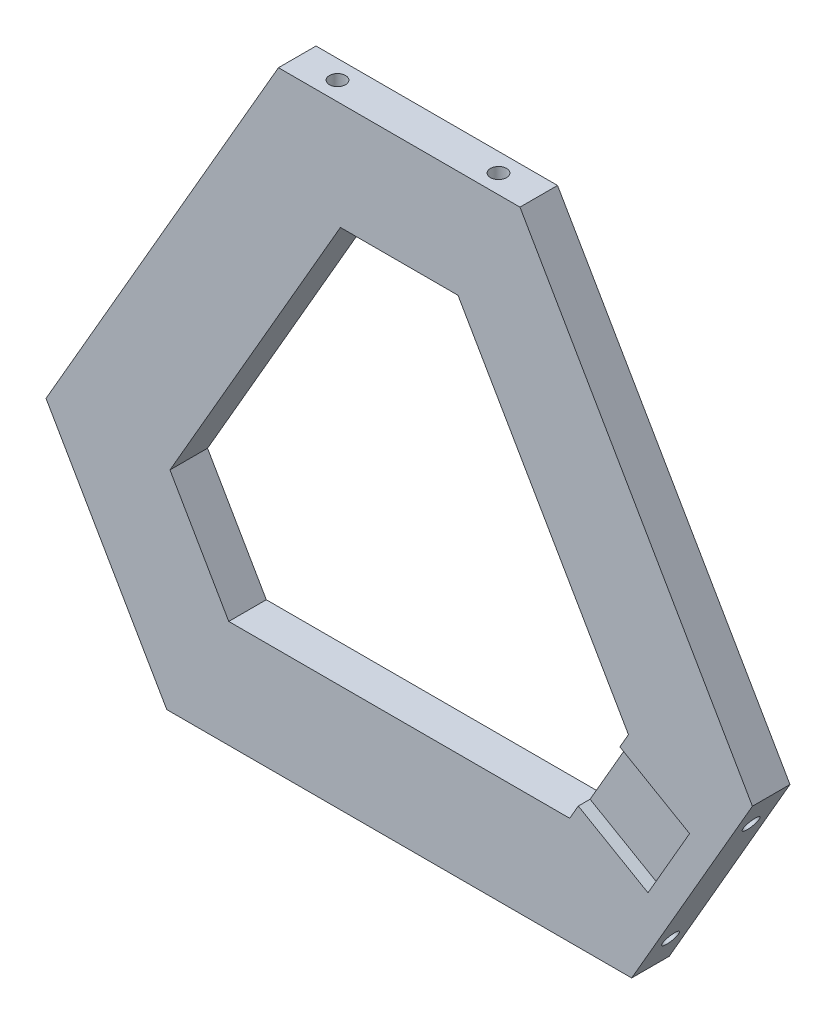
ISO-10303-21;
HEADER;
FILE_DESCRIPTION(('STEP AP214'),'2;1');
FILE_NAME('part.step','',(''),(''),'','','');
FILE_SCHEMA(('AUTOMOTIVE_DESIGN { 1 0 10303 214 1 1 1 1 }'));
ENDSEC;
DATA;
#1=APPLICATION_CONTEXT('core data for automotive mechanical design processes');
#2=APPLICATION_PROTOCOL_DEFINITION('international standard','automotive_design',2000,#1);
#3=PRODUCT_CONTEXT('',#1,'mechanical');
#4=PRODUCT('Part','Part','',(#3));
#5=PRODUCT_RELATED_PRODUCT_CATEGORY('part','',(#4));
#6=PRODUCT_DEFINITION_FORMATION('','',#4);
#7=PRODUCT_DEFINITION_CONTEXT('part definition',#1,'design');
#8=PRODUCT_DEFINITION('design','',#6,#7);
#9=PRODUCT_DEFINITION_SHAPE('','',#8);
#10=(LENGTH_UNIT() NAMED_UNIT(*) SI_UNIT(.MILLI.,.METRE.));
#11=(NAMED_UNIT(*) PLANE_ANGLE_UNIT() SI_UNIT($,.RADIAN.));
#12=(NAMED_UNIT(*) SI_UNIT($,.STERADIAN.) SOLID_ANGLE_UNIT());
#13=UNCERTAINTY_MEASURE_WITH_UNIT(LENGTH_MEASURE(1.E-05),#10,'distance_accuracy_value','');
#14=(GEOMETRIC_REPRESENTATION_CONTEXT(3) GLOBAL_UNCERTAINTY_ASSIGNED_CONTEXT((#13)) GLOBAL_UNIT_ASSIGNED_CONTEXT((#10,
#11,#12)) REPRESENTATION_CONTEXT('',''));
#15=CARTESIAN_POINT('',(0.,0.,0.));
#16=DIRECTION('',(0.,0.,1.));
#17=DIRECTION('',(1.,0.,0.));
#18=AXIS2_PLACEMENT_3D('',#15,#16,#17);
#19=CARTESIAN_POINT('',(37.2390923627309,-21.5,0.));
#20=DIRECTION('',(0.866025403784439,-0.5,0.));
#21=DIRECTION('',(0.5,0.866025403784439,0.));
#22=AXIS2_PLACEMENT_3D('',#19,#20,#21);
#23=PLANE('',#22);
#24=DIRECTION('',(0.5,0.866025403784439,0.));
#25=VECTOR('',#24,1.);
#26=CARTESIAN_POINT('',(37.2390923627309,-21.5,0.));
#27=LINE('',#26,#25);
#28=CARTESIAN_POINT('',(41.1140923627309,-14.7883031206706,0.));
#29=VERTEX_POINT('',#28);
#30=CARTESIAN_POINT('',(42.7155896708346,-12.0144284148501,0.));
#31=VERTEX_POINT('',#30);
#32=EDGE_CURVE('E173',#29,#31,#27,.T.);
#33=ORIENTED_EDGE('',*,*,#32,.F.);
#34=DIRECTION('',(0.,0.,1.));
#35=VECTOR('',#34,1.);
#36=CARTESIAN_POINT('',(41.1140923627309,-14.7883031206706,4.8));
#37=LINE('',#36,#35);
#38=CARTESIAN_POINT('',(41.1140923627309,-14.7883031206706,7.));
#39=VERTEX_POINT('',#38);
#40=EDGE_CURVE('E159',#29,#39,#37,.T.);
#41=ORIENTED_EDGE('',*,*,#40,.T.);
#42=DIRECTION('',(0.5,0.866025403784439,0.));
#43=VECTOR('',#42,1.);
#44=CARTESIAN_POINT('',(37.2390923627309,-21.5,7.));
#45=LINE('',#44,#43);
#46=CARTESIAN_POINT('',(42.7155896708346,-12.0144284148501,7.));
#47=VERTEX_POINT('',#46);
#48=EDGE_CURVE('E55',#39,#47,#45,.T.);
#49=ORIENTED_EDGE('',*,*,#48,.T.);
#50=DIRECTION('',(0.,0.,1.));
#51=VECTOR('',#50,1.);
#52=CARTESIAN_POINT('',(42.7155896708346,-12.0144284148501,0.));
#53=LINE('',#52,#51);
#54=EDGE_CURVE('E180',#31,#47,#53,.T.);
#55=ORIENTED_EDGE('',*,*,#54,.F.);
#56=EDGE_LOOP('',(#33,#41,#49,#55));
#57=FACE_BOUND('',#56,.T.);
#58=ADVANCED_FACE('F32',(#57),#23,.F.);
#59=CARTESIAN_POINT('',(-65.8096004384197,-12.0144284148501,7.));
#60=DIRECTION('',(0.866025403784438,-0.5,0.));
#61=DIRECTION('',(0.5,0.866025403784439,0.));
#62=AXIS2_PLACEMENT_3D('',#59,#60,#61);
#63=PLANE('',#62);
#64=DIRECTION('',(-0.5,-0.866025403784438,0.));
#65=VECTOR('',#64,1.);
#66=CARTESIAN_POINT('',(-65.8096004384197,-12.0144284148501,0.));
#67=LINE('',#66,#65);
#68=CARTESIAN_POINT('',(-22.5,63.,0.));
#69=VERTEX_POINT('',#68);
#70=CARTESIAN_POINT('',(-65.8096004384197,-12.0144284148501,0.));
#71=VERTEX_POINT('',#70);
#72=EDGE_CURVE('E266',#69,#71,#67,.T.);
#73=ORIENTED_EDGE('',*,*,#72,.T.);
#74=DIRECTION('',(0.,0.,-1.));
#75=VECTOR('',#74,1.);
#76=CARTESIAN_POINT('',(-65.8096004384197,-12.0144284148501,7.));
#77=LINE('',#76,#75);
#78=CARTESIAN_POINT('',(-65.8096004384197,-12.0144284148501,7.));
#79=VERTEX_POINT('',#78);
#80=EDGE_CURVE('E11',#79,#71,#77,.T.);
#81=ORIENTED_EDGE('',*,*,#80,.F.);
#82=DIRECTION('',(-0.5,-0.866025403784438,0.));
#83=VECTOR('',#82,1.);
#84=CARTESIAN_POINT('',(-65.8096004384197,-12.0144284148501,7.));
#85=LINE('',#84,#83);
#86=CARTESIAN_POINT('',(-22.5,63.,7.));
#87=VERTEX_POINT('',#86);
#88=EDGE_CURVE('E269',#87,#79,#85,.T.);
#89=ORIENTED_EDGE('',*,*,#88,.F.);
#90=DIRECTION('',(0.,0.,-1.));
#91=VECTOR('',#90,1.);
#92=CARTESIAN_POINT('',(-22.5,63.,7.));
#93=LINE('',#92,#91);
#94=EDGE_CURVE('E283',#87,#69,#93,.T.);
#95=ORIENTED_EDGE('',*,*,#94,.T.);
#96=EDGE_LOOP('',(#73,#81,#89,#95));
#97=FACE_BOUND('',#96,.T.);
#98=ADVANCED_FACE('F34',(#97),#63,.F.);
#99=CARTESIAN_POINT('',(-43.3096004384196,-50.9855715851499,7.));
#100=DIRECTION('',(0.866025403784438,0.500000000000001,0.));
#101=DIRECTION('',(-0.500000000000001,0.866025403784438,0.));
#102=AXIS2_PLACEMENT_3D('',#99,#100,#101);
#103=PLANE('',#102);
#104=CARTESIAN_POINT('',(-47.0596004384196,-44.4903810567666,3.5));
#105=DIRECTION('',(-0.866025403784438,-0.500000000000001,0.));
#106=DIRECTION('',(-0.500000000000001,0.866025403784438,0.));
#107=AXIS2_PLACEMENT_3D('',#104,#105,#106);
#108=CIRCLE('',#107,1.5);
#109=CARTESIAN_POINT('',(-47.8096004384196,-43.19134295109,3.5));
#110=VERTEX_POINT('',#109);
#111=EDGE_CURVE('E254',#110,#110,#108,.T.);
#112=ORIENTED_EDGE('',*,*,#111,.F.);
#113=EDGE_LOOP('',(#112));
#114=FACE_BOUND('',#113,.T.);
#115=CARTESIAN_POINT('',(-62.0596004384196,-18.5096189432335,3.5));
#116=DIRECTION('',(-0.866025403784438,-0.500000000000001,0.));
#117=DIRECTION('',(0.500000000000001,-0.866025403784438,0.));
#118=AXIS2_PLACEMENT_3D('',#115,#116,#117);
#119=CIRCLE('',#118,1.5);
#120=CARTESIAN_POINT('',(-61.3096004384196,-19.8086570489101,3.5));
#121=VERTEX_POINT('',#120);
#122=EDGE_CURVE('E260',#121,#121,#119,.T.);
#123=ORIENTED_EDGE('',*,*,#122,.F.);
#124=EDGE_LOOP('',(#123));
#125=FACE_BOUND('',#124,.T.);
#126=DIRECTION('',(0.500000000000001,-0.866025403784438,0.));
#127=VECTOR('',#126,1.);
#128=CARTESIAN_POINT('',(-43.3096004384196,-50.9855715851499,0.));
#129=LINE('',#128,#127);
#130=CARTESIAN_POINT('',(-43.3096004384196,-50.9855715851499,0.));
#131=VERTEX_POINT('',#130);
#132=EDGE_CURVE('E286',#71,#131,#129,.T.);
#133=ORIENTED_EDGE('',*,*,#132,.T.);
#134=DIRECTION('',(0.,0.,-1.));
#135=VECTOR('',#134,1.);
#136=CARTESIAN_POINT('',(-43.3096004384196,-50.9855715851499,7.));
#137=LINE('',#136,#135);
#138=CARTESIAN_POINT('',(-43.3096004384196,-50.9855715851499,7.));
#139=VERTEX_POINT('',#138);
#140=EDGE_CURVE('E40',#139,#131,#137,.T.);
#141=ORIENTED_EDGE('',*,*,#140,.F.);
#142=DIRECTION('',(0.500000000000001,-0.866025403784438,0.));
#143=VECTOR('',#142,1.);
#144=CARTESIAN_POINT('',(-43.3096004384196,-50.9855715851499,7.));
#145=LINE('',#144,#143);
#146=EDGE_CURVE('E272',#79,#139,#145,.T.);
#147=ORIENTED_EDGE('',*,*,#146,.F.);
#148=ORIENTED_EDGE('',*,*,#80,.T.);
#149=EDGE_LOOP('',(#133,#141,#147,#148));
#150=FACE_BOUND('',#149,.T.);
#151=ADVANCED_FACE('F331',(#114,#125,#150),#103,.F.);
#152=CARTESIAN_POINT('',(43.3096004384196,-50.9855715851499,7.));
#153=DIRECTION('',(0.,1.,0.));
#154=DIRECTION('',(-1.,0.,0.));
#155=AXIS2_PLACEMENT_3D('',#152,#153,#154);
#156=PLANE('',#155);
#157=DIRECTION('',(1.,0.,0.));
#158=VECTOR('',#157,1.);
#159=CARTESIAN_POINT('',(43.3096004384196,-50.9855715851499,0.));
#160=LINE('',#159,#158);
#161=CARTESIAN_POINT('',(43.3096004384196,-50.9855715851499,0.));
#162=VERTEX_POINT('',#161);
#163=EDGE_CURVE('E288',#131,#162,#160,.T.);
#164=ORIENTED_EDGE('',*,*,#163,.T.);
#165=DIRECTION('',(0.,0.,-1.));
#166=VECTOR('',#165,1.);
#167=CARTESIAN_POINT('',(43.3096004384196,-50.9855715851499,7.));
#168=LINE('',#167,#166);
#169=CARTESIAN_POINT('',(43.3096004384196,-50.9855715851499,7.));
#170=VERTEX_POINT('',#169);
#171=EDGE_CURVE('E303',#170,#162,#168,.T.);
#172=ORIENTED_EDGE('',*,*,#171,.F.);
#173=DIRECTION('',(1.,0.,0.));
#174=VECTOR('',#173,1.);
#175=CARTESIAN_POINT('',(43.3096004384196,-50.9855715851499,7.));
#176=LINE('',#175,#174);
#177=EDGE_CURVE('E275',#139,#170,#176,.T.);
#178=ORIENTED_EDGE('',*,*,#177,.F.);
#179=ORIENTED_EDGE('',*,*,#140,.T.);
#180=EDGE_LOOP('',(#164,#172,#178,#179));
#181=FACE_BOUND('',#180,.T.);
#182=ADVANCED_FACE('F310',(#181),#156,.F.);
#183=CARTESIAN_POINT('',(65.8096004384196,-12.0144284148501,7.));
#184=DIRECTION('',(-0.866025403784439,0.5,0.));
#185=DIRECTION('',(-0.5,-0.866025403784439,0.));
#186=AXIS2_PLACEMENT_3D('',#183,#184,#185);
#187=PLANE('',#186);
#188=CARTESIAN_POINT('',(47.0596004384196,-44.4903810567666,3.5));
#189=DIRECTION('',(0.866025403784439,-0.5,0.));
#190=DIRECTION('',(-0.5,-0.866025403784439,0.));
#191=AXIS2_PLACEMENT_3D('',#188,#189,#190);
#192=CIRCLE('',#191,1.5);
#193=CARTESIAN_POINT('',(46.3096004384196,-45.7894191624432,3.5));
#194=VERTEX_POINT('',#193);
#195=EDGE_CURVE('E242',#194,#194,#192,.T.);
#196=ORIENTED_EDGE('',*,*,#195,.F.);
#197=EDGE_LOOP('',(#196));
#198=FACE_BOUND('',#197,.T.);
#199=CARTESIAN_POINT('',(62.0596004384196,-18.5096189432334,3.5));
#200=DIRECTION('',(0.866025403784439,-0.5,0.));
#201=DIRECTION('',(0.5,0.866025403784439,0.));
#202=AXIS2_PLACEMENT_3D('',#199,#200,#201);
#203=CIRCLE('',#202,1.5);
#204=CARTESIAN_POINT('',(62.8096004384196,-17.2105808375568,3.5));
#205=VERTEX_POINT('',#204);
#206=EDGE_CURVE('E248',#205,#205,#203,.T.);
#207=ORIENTED_EDGE('',*,*,#206,.F.);
#208=EDGE_LOOP('',(#207));
#209=FACE_BOUND('',#208,.T.);
#210=DIRECTION('',(0.5,0.866025403784439,0.));
#211=VECTOR('',#210,1.);
#212=CARTESIAN_POINT('',(65.8096004384196,-12.0144284148501,0.));
#213=LINE('',#212,#211);
#214=CARTESIAN_POINT('',(65.8096004384196,-12.0144284148501,0.));
#215=VERTEX_POINT('',#214);
#216=EDGE_CURVE('E290',#162,#215,#213,.T.);
#217=ORIENTED_EDGE('',*,*,#216,.T.);
#218=DIRECTION('',(0.,0.,-1.));
#219=VECTOR('',#218,1.);
#220=CARTESIAN_POINT('',(65.8096004384196,-12.0144284148501,7.));
#221=LINE('',#220,#219);
#222=CARTESIAN_POINT('',(65.8096004384196,-12.0144284148501,7.));
#223=VERTEX_POINT('',#222);
#224=EDGE_CURVE('E300',#223,#215,#221,.T.);
#225=ORIENTED_EDGE('',*,*,#224,.F.);
#226=DIRECTION('',(0.5,0.866025403784439,0.));
#227=VECTOR('',#226,1.);
#228=CARTESIAN_POINT('',(65.8096004384196,-12.0144284148501,7.));
#229=LINE('',#228,#227);
#230=EDGE_CURVE('E277',#170,#223,#229,.T.);
#231=ORIENTED_EDGE('',*,*,#230,.F.);
#232=ORIENTED_EDGE('',*,*,#171,.T.);
#233=EDGE_LOOP('',(#217,#225,#231,#232));
#234=FACE_BOUND('',#233,.T.);
#235=ADVANCED_FACE('F319',(#198,#209,#234),#187,.F.);
#236=CARTESIAN_POINT('',(22.5,63.,7.));
#237=DIRECTION('',(-0.866025403784439,-0.5,0.));
#238=DIRECTION('',(0.5,-0.866025403784439,0.));
#239=AXIS2_PLACEMENT_3D('',#236,#237,#238);
#240=PLANE('',#239);
#241=DIRECTION('',(-0.5,0.866025403784439,0.));
#242=VECTOR('',#241,1.);
#243=CARTESIAN_POINT('',(22.5,63.,0.));
#244=LINE('',#243,#242);
#245=CARTESIAN_POINT('',(22.5,63.,0.));
#246=VERTEX_POINT('',#245);
#247=EDGE_CURVE('E292',#215,#246,#244,.T.);
#248=ORIENTED_EDGE('',*,*,#247,.T.);
#249=DIRECTION('',(0.,0.,-1.));
#250=VECTOR('',#249,1.);
#251=CARTESIAN_POINT('',(22.5,63.,7.));
#252=LINE('',#251,#250);
#253=CARTESIAN_POINT('',(22.5,63.,7.));
#254=VERTEX_POINT('',#253);
#255=EDGE_CURVE('E297',#254,#246,#252,.T.);
#256=ORIENTED_EDGE('',*,*,#255,.F.);
#257=DIRECTION('',(-0.5,0.866025403784439,0.));
#258=VECTOR('',#257,1.);
#259=CARTESIAN_POINT('',(22.5,63.,7.));
#260=LINE('',#259,#258);
#261=EDGE_CURVE('E279',#223,#254,#260,.T.);
#262=ORIENTED_EDGE('',*,*,#261,.F.);
#263=ORIENTED_EDGE('',*,*,#224,.T.);
#264=EDGE_LOOP('',(#248,#256,#262,#263));
#265=FACE_BOUND('',#264,.T.);
#266=ADVANCED_FACE('F323',(#265),#240,.F.);
#267=CARTESIAN_POINT('',(-22.5,63.,7.));
#268=DIRECTION('',(0.,-1.,0.));
#269=DIRECTION('',(0.,0.,-1.));
#270=AXIS2_PLACEMENT_3D('',#267,#268,#269);
#271=PLANE('',#270);
#272=CARTESIAN_POINT('',(15.,63.,3.5));
#273=DIRECTION('',(0.,1.,0.));
#274=DIRECTION('',(0.,0.,-1.));
#275=AXIS2_PLACEMENT_3D('',#272,#273,#274);
#276=CIRCLE('',#275,1.5);
#277=CARTESIAN_POINT('',(15.,63.,2.));
#278=VERTEX_POINT('',#277);
#279=EDGE_CURVE('E223',#278,#278,#276,.T.);
#280=ORIENTED_EDGE('',*,*,#279,.F.);
#281=EDGE_LOOP('',(#280));
#282=FACE_BOUND('',#281,.T.);
#283=CARTESIAN_POINT('',(-15.,63.,3.5));
#284=DIRECTION('',(0.,1.,0.));
#285=DIRECTION('',(0.,0.,1.));
#286=AXIS2_PLACEMENT_3D('',#283,#284,#285);
#287=CIRCLE('',#286,1.5);
#288=CARTESIAN_POINT('',(-15.,63.,5.));
#289=VERTEX_POINT('',#288);
#290=EDGE_CURVE('E236',#289,#289,#287,.T.);
#291=ORIENTED_EDGE('',*,*,#290,.F.);
#292=EDGE_LOOP('',(#291));
#293=FACE_BOUND('',#292,.T.);
#294=DIRECTION('',(-1.,0.,0.));
#295=VECTOR('',#294,1.);
#296=CARTESIAN_POINT('',(-22.5,63.,0.));
#297=LINE('',#296,#295);
#298=EDGE_CURVE('E273',#246,#69,#297,.T.);
#299=ORIENTED_EDGE('',*,*,#298,.T.);
#300=ORIENTED_EDGE('',*,*,#94,.F.);
#301=DIRECTION('',(-1.,0.,0.));
#302=VECTOR('',#301,1.);
#303=CARTESIAN_POINT('',(-22.5,63.,7.));
#304=LINE('',#303,#302);
#305=EDGE_CURVE('E281',#254,#87,#304,.T.);
#306=ORIENTED_EDGE('',*,*,#305,.F.);
#307=ORIENTED_EDGE('',*,*,#255,.T.);
#308=EDGE_LOOP('',(#299,#300,#306,#307));
#309=FACE_BOUND('',#308,.T.);
#310=ADVANCED_FACE('F334',(#282,#293,#309),#271,.F.);
#311=CARTESIAN_POINT('',(0.,0.,7.));
#312=DIRECTION('',(0.,0.,-1.));
#313=DIRECTION('',(-1.,0.,0.));
#314=AXIS2_PLACEMENT_3D('',#311,#312,#313);
#315=PLANE('',#314);
#316=ORIENTED_EDGE('',*,*,#48,.F.);
#317=DIRECTION('',(-0.866025403784438,0.5,0.));
#318=VECTOR('',#317,1.);
#319=CARTESIAN_POINT('',(41.1140923627309,-14.7883031206706,7.));
#320=LINE('',#319,#318);
#321=CARTESIAN_POINT('',(54.1044734194974,-22.2883031206706,7.));
#322=VERTEX_POINT('',#321);
#323=EDGE_CURVE('E165',#322,#39,#320,.T.);
#324=ORIENTED_EDGE('',*,*,#323,.F.);
#325=DIRECTION('',(0.5,0.866025403784439,0.));
#326=VECTOR('',#325,1.);
#327=CARTESIAN_POINT('',(54.1044734194974,-22.2883031206706,7.));
#328=LINE('',#327,#326);
#329=CARTESIAN_POINT('',(46.3544734194974,-35.7116968793294,7.));
#330=VERTEX_POINT('',#329);
#331=EDGE_CURVE('E380',#330,#322,#328,.T.);
#332=ORIENTED_EDGE('',*,*,#331,.F.);
#333=DIRECTION('',(0.866025403784439,-0.5,0.));
#334=VECTOR('',#333,1.);
#335=CARTESIAN_POINT('',(46.3544734194974,-35.7116968793294,7.));
#336=LINE('',#335,#334);
#337=CARTESIAN_POINT('',(33.3640923627309,-28.2116968793294,7.));
#338=VERTEX_POINT('',#337);
#339=EDGE_CURVE('E387',#338,#330,#336,.T.);
#340=ORIENTED_EDGE('',*,*,#339,.F.);
#341=CARTESIAN_POINT('',(31.7625950546271,-30.9855715851499,7.));
#342=VERTEX_POINT('',#341);
#343=EDGE_CURVE('E207',#342,#338,#45,.T.);
#344=ORIENTED_EDGE('',*,*,#343,.F.);
#345=DIRECTION('',(1.,0.,0.));
#346=VECTOR('',#345,1.);
#347=CARTESIAN_POINT('',(0.,-30.9855715851499,7.));
#348=LINE('',#347,#346);
#349=CARTESIAN_POINT('',(-31.7625950546271,-30.9855715851499,7.));
#350=VERTEX_POINT('',#349);
#351=EDGE_CURVE('E183',#350,#342,#348,.T.);
#352=ORIENTED_EDGE('',*,*,#351,.F.);
#353=DIRECTION('',(0.500000000000001,-0.866025403784438,0.));
#354=VECTOR('',#353,1.);
#355=CARTESIAN_POINT('',(-37.2390923627308,-21.5,7.));
#356=LINE('',#355,#354);
#357=CARTESIAN_POINT('',(-42.7155896708346,-12.0144284148501,7.));
#358=VERTEX_POINT('',#357);
#359=EDGE_CURVE('E188',#358,#350,#356,.T.);
#360=ORIENTED_EDGE('',*,*,#359,.F.);
#361=DIRECTION('',(-0.5,-0.866025403784439,0.));
#362=VECTOR('',#361,1.);
#363=CARTESIAN_POINT('',(-26.834292143521,15.4927857925749,7.));
#364=LINE('',#363,#362);
#365=CARTESIAN_POINT('',(-10.9529946162075,43.,7.));
#366=VERTEX_POINT('',#365);
#367=EDGE_CURVE('E216',#366,#358,#364,.T.);
#368=ORIENTED_EDGE('',*,*,#367,.F.);
#369=DIRECTION('',(-1.,0.,0.));
#370=VECTOR('',#369,1.);
#371=CARTESIAN_POINT('',(0.,43.,7.));
#372=LINE('',#371,#370);
#373=CARTESIAN_POINT('',(10.9529946162075,43.,7.));
#374=VERTEX_POINT('',#373);
#375=EDGE_CURVE('E213',#374,#366,#372,.T.);
#376=ORIENTED_EDGE('',*,*,#375,.F.);
#377=DIRECTION('',(-0.5,0.866025403784439,0.));
#378=VECTOR('',#377,1.);
#379=CARTESIAN_POINT('',(26.8342921435211,15.4927857925749,7.));
#380=LINE('',#379,#378);
#381=EDGE_CURVE('E210',#47,#374,#380,.T.);
#382=ORIENTED_EDGE('',*,*,#381,.F.);
#383=EDGE_LOOP('',(#316,#324,#332,#340,#344,#352,#360,#368,#376,#382));
#384=FACE_BOUND('',#383,.T.);
#385=ORIENTED_EDGE('',*,*,#88,.T.);
#386=ORIENTED_EDGE('',*,*,#146,.T.);
#387=ORIENTED_EDGE('',*,*,#177,.T.);
#388=ORIENTED_EDGE('',*,*,#230,.T.);
#389=ORIENTED_EDGE('',*,*,#261,.T.);
#390=ORIENTED_EDGE('',*,*,#305,.T.);
#391=EDGE_LOOP('',(#385,#386,#387,#388,#389,#390));
#392=FACE_BOUND('',#391,.T.);
#393=ADVANCED_FACE('F327',(#384,#392),#315,.F.);
#394=CARTESIAN_POINT('',(0.,0.,0.));
#395=DIRECTION('',(0.,0.,-1.));
#396=DIRECTION('',(-1.,0.,0.));
#397=AXIS2_PLACEMENT_3D('',#394,#395,#396);
#398=PLANE('',#397);
#399=DIRECTION('',(-0.866025403784438,0.5,0.));
#400=VECTOR('',#399,1.);
#401=CARTESIAN_POINT('',(41.1140923627309,-14.7883031206706,0.));
#402=LINE('',#401,#400);
#403=CARTESIAN_POINT('',(54.1044734194974,-22.2883031206706,0.));
#404=VERTEX_POINT('',#403);
#405=EDGE_CURVE('E162',#404,#29,#402,.T.);
#406=ORIENTED_EDGE('',*,*,#405,.T.);
#407=ORIENTED_EDGE('',*,*,#32,.T.);
#408=DIRECTION('',(-0.5,0.866025403784439,0.));
#409=VECTOR('',#408,1.);
#410=CARTESIAN_POINT('',(26.8342921435211,15.4927857925749,0.));
#411=LINE('',#410,#409);
#412=CARTESIAN_POINT('',(10.9529946162075,43.,0.));
#413=VERTEX_POINT('',#412);
#414=EDGE_CURVE('E186',#31,#413,#411,.T.);
#415=ORIENTED_EDGE('',*,*,#414,.T.);
#416=DIRECTION('',(-1.,0.,0.));
#417=VECTOR('',#416,1.);
#418=CARTESIAN_POINT('',(0.,43.,0.));
#419=LINE('',#418,#417);
#420=CARTESIAN_POINT('',(-10.9529946162075,43.,0.));
#421=VERTEX_POINT('',#420);
#422=EDGE_CURVE('E195',#413,#421,#419,.T.);
#423=ORIENTED_EDGE('',*,*,#422,.T.);
#424=DIRECTION('',(-0.5,-0.866025403784439,0.));
#425=VECTOR('',#424,1.);
#426=CARTESIAN_POINT('',(-26.834292143521,15.4927857925749,0.));
#427=LINE('',#426,#425);
#428=CARTESIAN_POINT('',(-42.7155896708346,-12.0144284148501,0.));
#429=VERTEX_POINT('',#428);
#430=EDGE_CURVE('E198',#421,#429,#427,.T.);
#431=ORIENTED_EDGE('',*,*,#430,.T.);
#432=DIRECTION('',(0.500000000000001,-0.866025403784438,0.));
#433=VECTOR('',#432,1.);
#434=CARTESIAN_POINT('',(-37.2390923627308,-21.5,0.));
#435=LINE('',#434,#433);
#436=CARTESIAN_POINT('',(-31.7625950546271,-30.9855715851499,0.));
#437=VERTEX_POINT('',#436);
#438=EDGE_CURVE('E201',#429,#437,#435,.T.);
#439=ORIENTED_EDGE('',*,*,#438,.T.);
#440=DIRECTION('',(1.,0.,0.));
#441=VECTOR('',#440,1.);
#442=CARTESIAN_POINT('',(0.,-30.9855715851499,0.));
#443=LINE('',#442,#441);
#444=CARTESIAN_POINT('',(31.7625950546271,-30.9855715851499,0.));
#445=VERTEX_POINT('',#444);
#446=EDGE_CURVE('E204',#437,#445,#443,.T.);
#447=ORIENTED_EDGE('',*,*,#446,.T.);
#448=CARTESIAN_POINT('',(39.7140923627309,-17.213174251267,0.));
#449=VERTEX_POINT('',#448);
#450=EDGE_CURVE('E182',#445,#449,#27,.T.);
#451=ORIENTED_EDGE('',*,*,#450,.T.);
#452=DIRECTION('',(0.866025403784439,-0.5,0.));
#453=VECTOR('',#452,1.);
#454=CARTESIAN_POINT('',(39.7140923627309,-17.213174251267,0.));
#455=LINE('',#454,#453);
#456=CARTESIAN_POINT('',(52.7044734194974,-24.713174251267,0.));
#457=VERTEX_POINT('',#456);
#458=EDGE_CURVE('E177',#449,#457,#455,.T.);
#459=ORIENTED_EDGE('',*,*,#458,.T.);
#460=DIRECTION('',(0.500000000000001,0.866025403784438,0.));
#461=VECTOR('',#460,1.);
#462=CARTESIAN_POINT('',(54.1044734194974,-22.2883031206706,0.));
#463=LINE('',#462,#461);
#464=EDGE_CURVE('E176',#457,#404,#463,.T.);
#465=ORIENTED_EDGE('',*,*,#464,.T.);
#466=EDGE_LOOP('',(#406,#407,#415,#423,#431,#439,#447,#451,#459,#465));
#467=FACE_BOUND('',#466,.T.);
#468=ORIENTED_EDGE('',*,*,#72,.F.);
#469=ORIENTED_EDGE('',*,*,#298,.F.);
#470=ORIENTED_EDGE('',*,*,#247,.F.);
#471=ORIENTED_EDGE('',*,*,#216,.F.);
#472=ORIENTED_EDGE('',*,*,#163,.F.);
#473=ORIENTED_EDGE('',*,*,#132,.F.);
#474=EDGE_LOOP('',(#468,#469,#470,#471,#472,#473));
#475=FACE_BOUND('',#474,.T.);
#476=ADVANCED_FACE('F170',(#467,#475),#398,.T.);
#477=CARTESIAN_POINT('',(-51.6672955930064,-12.5096189432335,3.5));
#478=DIRECTION('',(-0.866025403784438,-0.500000000000001,0.));
#479=DIRECTION('',(0.500000000000001,-0.866025403784438,0.));
#480=AXIS2_PLACEMENT_3D('',#477,#478,#479);
#481=CYLINDRICAL_SURFACE('',#480,1.5);
#482=CARTESIAN_POINT('',(-51.6672955930064,-12.5096189432335,3.5));
#483=DIRECTION('',(-0.866025403784438,-0.500000000000001,0.));
#484=DIRECTION('',(0.500000000000001,-0.866025403784438,0.));
#485=AXIS2_PLACEMENT_3D('',#482,#483,#484);
#486=CIRCLE('',#485,1.5);
#487=CARTESIAN_POINT('',(-50.9172955930064,-13.8086570489101,3.5));
#488=VERTEX_POINT('',#487);
#489=EDGE_CURVE('E263',#488,#488,#486,.T.);
#490=ORIENTED_EDGE('',*,*,#489,.F.);
#491=EDGE_LOOP('',(#490));
#492=FACE_BOUND('',#491,.T.);
#493=ORIENTED_EDGE('',*,*,#122,.T.);
#494=EDGE_LOOP('',(#493));
#495=FACE_BOUND('',#494,.T.);
#496=ADVANCED_FACE('F475',(#492,#495),#481,.F.);
#497=CARTESIAN_POINT('',(-51.6672955930064,-12.5096189432335,3.5));
#498=DIRECTION('',(-0.866025403784438,-0.500000000000001,0.));
#499=DIRECTION('',(0.500000000000001,-0.866025403784438,0.));
#500=AXIS2_PLACEMENT_3D('',#497,#498,#499);
#501=PLANE('',#500);
#502=ORIENTED_EDGE('',*,*,#489,.T.);
#503=EDGE_LOOP('',(#502));
#504=FACE_BOUND('',#503,.T.);
#505=ADVANCED_FACE('F634',(#504),#501,.T.);
#506=CARTESIAN_POINT('',(-36.6672955930063,-38.4903810567666,3.5));
#507=DIRECTION('',(-0.866025403784438,-0.500000000000001,0.));
#508=DIRECTION('',(0.500000000000001,-0.866025403784438,0.));
#509=AXIS2_PLACEMENT_3D('',#506,#507,#508);
#510=CYLINDRICAL_SURFACE('',#509,1.5);
#511=CARTESIAN_POINT('',(-36.6672955930063,-38.4903810567666,3.5));
#512=DIRECTION('',(-0.866025403784438,-0.500000000000001,0.));
#513=DIRECTION('',(-0.500000000000001,0.866025403784438,0.));
#514=AXIS2_PLACEMENT_3D('',#511,#512,#513);
#515=CIRCLE('',#514,1.5);
#516=CARTESIAN_POINT('',(-37.4172955930063,-37.19134295109,3.5));
#517=VERTEX_POINT('',#516);
#518=EDGE_CURVE('E257',#517,#517,#515,.T.);
#519=ORIENTED_EDGE('',*,*,#518,.F.);
#520=EDGE_LOOP('',(#519));
#521=FACE_BOUND('',#520,.T.);
#522=ORIENTED_EDGE('',*,*,#111,.T.);
#523=EDGE_LOOP('',(#522));
#524=FACE_BOUND('',#523,.T.);
#525=ADVANCED_FACE('F624',(#521,#524),#510,.F.);
#526=CARTESIAN_POINT('',(-36.6672955930063,-38.4903810567666,3.5));
#527=DIRECTION('',(0.866025403784438,0.500000000000001,0.));
#528=DIRECTION('',(-0.500000000000001,0.866025403784438,0.));
#529=AXIS2_PLACEMENT_3D('',#526,#527,#528);
#530=PLANE('',#529);
#531=ORIENTED_EDGE('',*,*,#518,.T.);
#532=EDGE_LOOP('',(#531));
#533=FACE_BOUND('',#532,.T.);
#534=ADVANCED_FACE('F603',(#533),#530,.F.);
#535=CARTESIAN_POINT('',(51.6672955930064,-12.5096189432334,3.5));
#536=DIRECTION('',(0.866025403784439,-0.5,0.));
#537=DIRECTION('',(0.5,0.866025403784439,0.));
#538=AXIS2_PLACEMENT_3D('',#535,#536,#537);
#539=CYLINDRICAL_SURFACE('',#538,1.5);
#540=CARTESIAN_POINT('',(51.6672955930064,-12.5096189432334,3.5));
#541=DIRECTION('',(0.866025403784439,-0.5,0.));
#542=DIRECTION('',(0.5,0.866025403784439,0.));
#543=AXIS2_PLACEMENT_3D('',#540,#541,#542);
#544=CIRCLE('',#543,1.5);
#545=CARTESIAN_POINT('',(52.4172955930064,-11.2105808375568,3.5));
#546=VERTEX_POINT('',#545);
#547=EDGE_CURVE('E251',#546,#546,#544,.T.);
#548=ORIENTED_EDGE('',*,*,#547,.F.);
#549=EDGE_LOOP('',(#548));
#550=FACE_BOUND('',#549,.T.);
#551=ORIENTED_EDGE('',*,*,#206,.T.);
#552=EDGE_LOOP('',(#551));
#553=FACE_BOUND('',#552,.T.);
#554=ADVANCED_FACE('F593',(#550,#553),#539,.F.);
#555=CARTESIAN_POINT('',(51.6672955930064,-12.5096189432334,3.5));
#556=DIRECTION('',(0.866025403784439,-0.5,0.));
#557=DIRECTION('',(0.5,0.866025403784439,0.));
#558=AXIS2_PLACEMENT_3D('',#555,#556,#557);
#559=PLANE('',#558);
#560=ORIENTED_EDGE('',*,*,#547,.T.);
#561=EDGE_LOOP('',(#560));
#562=FACE_BOUND('',#561,.T.);
#563=ADVANCED_FACE('F583',(#562),#559,.T.);
#564=CARTESIAN_POINT('',(36.6672955930064,-38.4903810567666,3.5));
#565=DIRECTION('',(0.866025403784439,-0.5,0.));
#566=DIRECTION('',(0.5,0.866025403784439,0.));
#567=AXIS2_PLACEMENT_3D('',#564,#565,#566);
#568=CYLINDRICAL_SURFACE('',#567,1.5);
#569=CARTESIAN_POINT('',(36.6672955930064,-38.4903810567666,3.5));
#570=DIRECTION('',(0.866025403784439,-0.5,0.));
#571=DIRECTION('',(-0.5,-0.866025403784439,0.));
#572=AXIS2_PLACEMENT_3D('',#569,#570,#571);
#573=CIRCLE('',#572,1.5);
#574=CARTESIAN_POINT('',(35.9172955930064,-39.7894191624432,3.5));
#575=VERTEX_POINT('',#574);
#576=EDGE_CURVE('E245',#575,#575,#573,.T.);
#577=ORIENTED_EDGE('',*,*,#576,.F.);
#578=EDGE_LOOP('',(#577));
#579=FACE_BOUND('',#578,.T.);
#580=ORIENTED_EDGE('',*,*,#195,.T.);
#581=EDGE_LOOP('',(#580));
#582=FACE_BOUND('',#581,.T.);
#583=ADVANCED_FACE('F573',(#579,#582),#568,.F.);
#584=CARTESIAN_POINT('',(36.6672955930064,-38.4903810567666,3.5));
#585=DIRECTION('',(-0.866025403784439,0.5,0.));
#586=DIRECTION('',(-0.5,-0.866025403784439,0.));
#587=AXIS2_PLACEMENT_3D('',#584,#585,#586);
#588=PLANE('',#587);
#589=ORIENTED_EDGE('',*,*,#576,.T.);
#590=EDGE_LOOP('',(#589));
#591=FACE_BOUND('',#590,.T.);
#592=ADVANCED_FACE('F557',(#591),#588,.F.);
#593=CARTESIAN_POINT('',(-15.,51.,3.5));
#594=DIRECTION('',(0.,1.,0.));
#595=DIRECTION('',(0.,0.,1.));
#596=AXIS2_PLACEMENT_3D('',#593,#594,#595);
#597=CYLINDRICAL_SURFACE('',#596,1.5);
#598=CARTESIAN_POINT('',(-15.,51.,3.5));
#599=DIRECTION('',(0.,1.,0.));
#600=DIRECTION('',(0.,0.,1.));
#601=AXIS2_PLACEMENT_3D('',#598,#599,#600);
#602=CIRCLE('',#601,1.5);
#603=CARTESIAN_POINT('',(-15.,51.,5.));
#604=VERTEX_POINT('',#603);
#605=EDGE_CURVE('E239',#604,#604,#602,.T.);
#606=ORIENTED_EDGE('',*,*,#605,.F.);
#607=EDGE_LOOP('',(#606));
#608=FACE_BOUND('',#607,.T.);
#609=ORIENTED_EDGE('',*,*,#290,.T.);
#610=EDGE_LOOP('',(#609));
#611=FACE_BOUND('',#610,.T.);
#612=ADVANCED_FACE('F548',(#608,#611),#597,.F.);
#613=CARTESIAN_POINT('',(-15.,51.,3.5));
#614=DIRECTION('',(0.,1.,0.));
#615=DIRECTION('',(0.,0.,1.));
#616=AXIS2_PLACEMENT_3D('',#613,#614,#615);
#617=PLANE('',#616);
#618=ORIENTED_EDGE('',*,*,#605,.T.);
#619=EDGE_LOOP('',(#618));
#620=FACE_BOUND('',#619,.T.);
#621=ADVANCED_FACE('F538',(#620),#617,.T.);
#622=CARTESIAN_POINT('',(15.,51.,3.5));
#623=DIRECTION('',(0.,1.,0.));
#624=DIRECTION('',(0.,0.,1.));
#625=AXIS2_PLACEMENT_3D('',#622,#623,#624);
#626=CYLINDRICAL_SURFACE('',#625,1.5);
#627=CARTESIAN_POINT('',(15.,51.,3.5));
#628=DIRECTION('',(0.,1.,0.));
#629=DIRECTION('',(0.,0.,-1.));
#630=AXIS2_PLACEMENT_3D('',#627,#628,#629);
#631=CIRCLE('',#630,1.5);
#632=CARTESIAN_POINT('',(15.,51.,2.));
#633=VERTEX_POINT('',#632);
#634=EDGE_CURVE('E233',#633,#633,#631,.T.);
#635=ORIENTED_EDGE('',*,*,#634,.F.);
#636=EDGE_LOOP('',(#635));
#637=FACE_BOUND('',#636,.T.);
#638=ORIENTED_EDGE('',*,*,#279,.T.);
#639=EDGE_LOOP('',(#638));
#640=FACE_BOUND('',#639,.T.);
#641=ADVANCED_FACE('F367',(#637,#640),#626,.F.);
#642=CARTESIAN_POINT('',(15.,51.,3.5));
#643=DIRECTION('',(0.,-1.,0.));
#644=DIRECTION('',(0.,0.,-1.));
#645=AXIS2_PLACEMENT_3D('',#642,#643,#644);
#646=PLANE('',#645);
#647=ORIENTED_EDGE('',*,*,#634,.T.);
#648=EDGE_LOOP('',(#647));
#649=FACE_BOUND('',#648,.T.);
#650=ADVANCED_FACE('F358',(#649),#646,.F.);
#651=DIRECTION('',(-0.5,-0.866025403784439,0.));
#652=VECTOR('',#651,1.);
#653=CARTESIAN_POINT('',(33.3640923627309,-28.2116968793294,4.8));
#654=LINE('',#653,#652);
#655=CARTESIAN_POINT('',(39.7140923627309,-17.213174251267,4.8));
#656=VERTEX_POINT('',#655);
#657=CARTESIAN_POINT('',(33.3640923627309,-28.2116968793294,4.8));
#658=VERTEX_POINT('',#657);
#659=EDGE_CURVE('E371',#656,#658,#654,.T.);
#660=ORIENTED_EDGE('',*,*,#659,.F.);
#661=DIRECTION('',(0.,0.,1.));
#662=VECTOR('',#661,1.);
#663=CARTESIAN_POINT('',(39.7140923627309,-17.213174251267,0.));
#664=LINE('',#663,#662);
#665=EDGE_CURVE('E47',#449,#656,#664,.T.);
#666=ORIENTED_EDGE('',*,*,#665,.F.);
#667=ORIENTED_EDGE('',*,*,#450,.F.);
#668=DIRECTION('',(0.,0.,1.));
#669=VECTOR('',#668,1.);
#670=CARTESIAN_POINT('',(31.7625950546271,-30.9855715851499,0.));
#671=LINE('',#670,#669);
#672=EDGE_CURVE('E221',#445,#342,#671,.T.);
#673=ORIENTED_EDGE('',*,*,#672,.T.);
#674=ORIENTED_EDGE('',*,*,#343,.T.);
#675=DIRECTION('',(0.,0.,1.));
#676=VECTOR('',#675,1.);
#677=CARTESIAN_POINT('',(33.3640923627309,-28.2116968793294,4.8));
#678=LINE('',#677,#676);
#679=EDGE_CURVE('E192',#658,#338,#678,.T.);
#680=ORIENTED_EDGE('',*,*,#679,.F.);
#681=EDGE_LOOP('',(#660,#666,#667,#673,#674,#680));
#682=FACE_BOUND('',#681,.T.);
#683=ADVANCED_FACE('F350',(#682),#23,.F.);
#684=CARTESIAN_POINT('',(0.,-30.9855715851499,0.));
#685=DIRECTION('',(0.,-1.,0.));
#686=DIRECTION('',(1.,0.,0.));
#687=AXIS2_PLACEMENT_3D('',#684,#685,#686);
#688=PLANE('',#687);
#689=ORIENTED_EDGE('',*,*,#351,.T.);
#690=ORIENTED_EDGE('',*,*,#672,.F.);
#691=ORIENTED_EDGE('',*,*,#446,.F.);
#692=DIRECTION('',(0.,0.,1.));
#693=VECTOR('',#692,1.);
#694=CARTESIAN_POINT('',(-31.7625950546271,-30.9855715851499,0.));
#695=LINE('',#694,#693);
#696=EDGE_CURVE('E224',#437,#350,#695,.T.);
#697=ORIENTED_EDGE('',*,*,#696,.T.);
#698=EDGE_LOOP('',(#689,#690,#691,#697));
#699=FACE_BOUND('',#698,.T.);
#700=ADVANCED_FACE('F357',(#699),#688,.F.);
#701=CARTESIAN_POINT('',(-37.2390923627308,-21.5,0.));
#702=DIRECTION('',(-0.866025403784438,-0.500000000000001,0.));
#703=DIRECTION('',(0.500000000000001,-0.866025403784438,0.));
#704=AXIS2_PLACEMENT_3D('',#701,#702,#703);
#705=PLANE('',#704);
#706=ORIENTED_EDGE('',*,*,#359,.T.);
#707=ORIENTED_EDGE('',*,*,#696,.F.);
#708=ORIENTED_EDGE('',*,*,#438,.F.);
#709=DIRECTION('',(0.,0.,1.));
#710=VECTOR('',#709,1.);
#711=CARTESIAN_POINT('',(-42.7155896708346,-12.0144284148501,0.));
#712=LINE('',#711,#710);
#713=EDGE_CURVE('E226',#429,#358,#712,.T.);
#714=ORIENTED_EDGE('',*,*,#713,.T.);
#715=EDGE_LOOP('',(#706,#707,#708,#714));
#716=FACE_BOUND('',#715,.T.);
#717=ADVANCED_FACE('F364',(#716),#705,.F.);
#718=CARTESIAN_POINT('',(-26.834292143521,15.4927857925749,0.));
#719=DIRECTION('',(-0.866025403784439,0.5,0.));
#720=DIRECTION('',(-0.5,-0.866025403784439,0.));
#721=AXIS2_PLACEMENT_3D('',#718,#719,#720);
#722=PLANE('',#721);
#723=ORIENTED_EDGE('',*,*,#367,.T.);
#724=ORIENTED_EDGE('',*,*,#713,.F.);
#725=ORIENTED_EDGE('',*,*,#430,.F.);
#726=DIRECTION('',(0.,0.,1.));
#727=VECTOR('',#726,1.);
#728=CARTESIAN_POINT('',(-10.9529946162075,43.,0.));
#729=LINE('',#728,#727);
#730=EDGE_CURVE('E228',#421,#366,#729,.T.);
#731=ORIENTED_EDGE('',*,*,#730,.T.);
#732=EDGE_LOOP('',(#723,#724,#725,#731));
#733=FACE_BOUND('',#732,.T.);
#734=ADVANCED_FACE('F410',(#733),#722,.F.);
#735=CARTESIAN_POINT('',(0.,43.,0.));
#736=DIRECTION('',(0.,1.,0.));
#737=DIRECTION('',(-1.,0.,0.));
#738=AXIS2_PLACEMENT_3D('',#735,#736,#737);
#739=PLANE('',#738);
#740=ORIENTED_EDGE('',*,*,#375,.T.);
#741=ORIENTED_EDGE('',*,*,#730,.F.);
#742=ORIENTED_EDGE('',*,*,#422,.F.);
#743=DIRECTION('',(0.,0.,1.));
#744=VECTOR('',#743,1.);
#745=CARTESIAN_POINT('',(10.9529946162075,43.,0.));
#746=LINE('',#745,#744);
#747=EDGE_CURVE('E230',#413,#374,#746,.T.);
#748=ORIENTED_EDGE('',*,*,#747,.T.);
#749=EDGE_LOOP('',(#740,#741,#742,#748));
#750=FACE_BOUND('',#749,.T.);
#751=ADVANCED_FACE('F412',(#750),#739,.F.);
#752=CARTESIAN_POINT('',(26.8342921435211,15.4927857925749,0.));
#753=DIRECTION('',(0.866025403784439,0.5,0.));
#754=DIRECTION('',(-0.5,0.866025403784439,0.));
#755=AXIS2_PLACEMENT_3D('',#752,#753,#754);
#756=PLANE('',#755);
#757=ORIENTED_EDGE('',*,*,#381,.T.);
#758=ORIENTED_EDGE('',*,*,#747,.F.);
#759=ORIENTED_EDGE('',*,*,#414,.F.);
#760=ORIENTED_EDGE('',*,*,#54,.T.);
#761=EDGE_LOOP('',(#757,#758,#759,#760));
#762=FACE_BOUND('',#761,.T.);
#763=ADVANCED_FACE('F416',(#762),#756,.F.);
#764=CARTESIAN_POINT('',(41.1140923627309,-14.7883031206706,4.8));
#765=DIRECTION('',(0.5,0.866025403784438,0.));
#766=DIRECTION('',(-0.866025403784438,0.5,0.));
#767=AXIS2_PLACEMENT_3D('',#764,#765,#766);
#768=PLANE('',#767);
#769=ORIENTED_EDGE('',*,*,#323,.T.);
#770=ORIENTED_EDGE('',*,*,#40,.F.);
#771=ORIENTED_EDGE('',*,*,#405,.F.);
#772=DIRECTION('',(0.,0.,1.));
#773=VECTOR('',#772,1.);
#774=CARTESIAN_POINT('',(54.1044734194974,-22.2883031206706,4.8));
#775=LINE('',#774,#773);
#776=EDGE_CURVE('E167',#404,#322,#775,.T.);
#777=ORIENTED_EDGE('',*,*,#776,.T.);
#778=EDGE_LOOP('',(#769,#770,#771,#777));
#779=FACE_BOUND('',#778,.T.);
#780=ADVANCED_FACE('F161',(#779),#768,.F.);
#781=CARTESIAN_POINT('',(54.1044734194974,-22.2883031206706,4.8));
#782=DIRECTION('',(0.866025403784439,-0.5,0.));
#783=DIRECTION('',(0.5,0.866025403784439,0.));
#784=AXIS2_PLACEMENT_3D('',#781,#782,#783);
#785=PLANE('',#784);
#786=ORIENTED_EDGE('',*,*,#331,.T.);
#787=ORIENTED_EDGE('',*,*,#776,.F.);
#788=ORIENTED_EDGE('',*,*,#464,.F.);
#789=DIRECTION('',(0.,0.,1.));
#790=VECTOR('',#789,1.);
#791=CARTESIAN_POINT('',(52.7044734194974,-24.713174251267,0.));
#792=LINE('',#791,#790);
#793=CARTESIAN_POINT('',(52.7044734194974,-24.713174251267,4.8));
#794=VERTEX_POINT('',#793);
#795=EDGE_CURVE('E390',#457,#794,#792,.T.);
#796=ORIENTED_EDGE('',*,*,#795,.T.);
#797=DIRECTION('',(0.5,0.866025403784439,0.));
#798=VECTOR('',#797,1.);
#799=CARTESIAN_POINT('',(54.1044734194974,-22.2883031206706,4.8));
#800=LINE('',#799,#798);
#801=CARTESIAN_POINT('',(46.3544734194974,-35.7116968793294,4.8));
#802=VERTEX_POINT('',#801);
#803=EDGE_CURVE('E378',#802,#794,#800,.T.);
#804=ORIENTED_EDGE('',*,*,#803,.F.);
#805=DIRECTION('',(0.,0.,1.));
#806=VECTOR('',#805,1.);
#807=CARTESIAN_POINT('',(46.3544734194974,-35.7116968793294,4.8));
#808=LINE('',#807,#806);
#809=EDGE_CURVE('E393',#802,#330,#808,.T.);
#810=ORIENTED_EDGE('',*,*,#809,.T.);
#811=EDGE_LOOP('',(#786,#787,#788,#796,#804,#810));
#812=FACE_BOUND('',#811,.T.);
#813=ADVANCED_FACE('F420',(#812),#785,.F.);
#814=CARTESIAN_POINT('',(46.3544734194974,-35.7116968793294,4.8));
#815=DIRECTION('',(-0.5,-0.866025403784439,0.));
#816=DIRECTION('',(0.866025403784439,-0.5,0.));
#817=AXIS2_PLACEMENT_3D('',#814,#815,#816);
#818=PLANE('',#817);
#819=ORIENTED_EDGE('',*,*,#339,.T.);
#820=ORIENTED_EDGE('',*,*,#809,.F.);
#821=DIRECTION('',(0.866025403784439,-0.5,0.));
#822=VECTOR('',#821,1.);
#823=CARTESIAN_POINT('',(46.3544734194974,-35.7116968793294,4.8));
#824=LINE('',#823,#822);
#825=EDGE_CURVE('E376',#658,#802,#824,.T.);
#826=ORIENTED_EDGE('',*,*,#825,.F.);
#827=ORIENTED_EDGE('',*,*,#679,.T.);
#828=EDGE_LOOP('',(#819,#820,#826,#827));
#829=FACE_BOUND('',#828,.T.);
#830=ADVANCED_FACE('F398',(#829),#818,.F.);
#831=CARTESIAN_POINT('',(0.,0.,4.8));
#832=DIRECTION('',(0.,0.,-1.));
#833=DIRECTION('',(-1.,0.,0.));
#834=AXIS2_PLACEMENT_3D('',#831,#832,#833);
#835=PLANE('',#834);
#836=ORIENTED_EDGE('',*,*,#803,.T.);
#837=DIRECTION('',(0.866025403784439,-0.5,0.));
#838=VECTOR('',#837,1.);
#839=CARTESIAN_POINT('',(39.7140923627309,-17.213174251267,4.8));
#840=LINE('',#839,#838);
#841=EDGE_CURVE('E178',#656,#794,#840,.T.);
#842=ORIENTED_EDGE('',*,*,#841,.F.);
#843=ORIENTED_EDGE('',*,*,#659,.T.);
#844=ORIENTED_EDGE('',*,*,#825,.T.);
#845=EDGE_LOOP('',(#836,#842,#843,#844));
#846=FACE_BOUND('',#845,.T.);
#847=ADVANCED_FACE('F422',(#846),#835,.F.);
#848=CARTESIAN_POINT('',(39.7140923627309,-17.213174251267,0.));
#849=DIRECTION('',(-0.5,-0.866025403784439,0.));
#850=DIRECTION('',(0.866025403784439,-0.5,0.));
#851=AXIS2_PLACEMENT_3D('',#848,#849,#850);
#852=PLANE('',#851);
#853=ORIENTED_EDGE('',*,*,#841,.T.);
#854=ORIENTED_EDGE('',*,*,#795,.F.);
#855=ORIENTED_EDGE('',*,*,#458,.F.);
#856=ORIENTED_EDGE('',*,*,#665,.T.);
#857=EDGE_LOOP('',(#853,#854,#855,#856));
#858=FACE_BOUND('',#857,.T.);
#859=ADVANCED_FACE('F421',(#858),#852,.F.);
#860=CLOSED_SHELL('',(#58,#98,#151,#182,#235,#266,#310,#393,#476,#496,#505,#525,#534,#554,#563,
#583,#592,#612,#621,#641,#650,#683,#700,#717,#734,#751,#763,#780,#813,#830,#847,#859));
#861=MANIFOLD_SOLID_BREP('B2',#860);
#862=ADVANCED_BREP_SHAPE_REPRESENTATION('',(#18,#861),#14);
#863=SHAPE_DEFINITION_REPRESENTATION(#9,#862);
ENDSEC;
END-ISO-10303-21;
